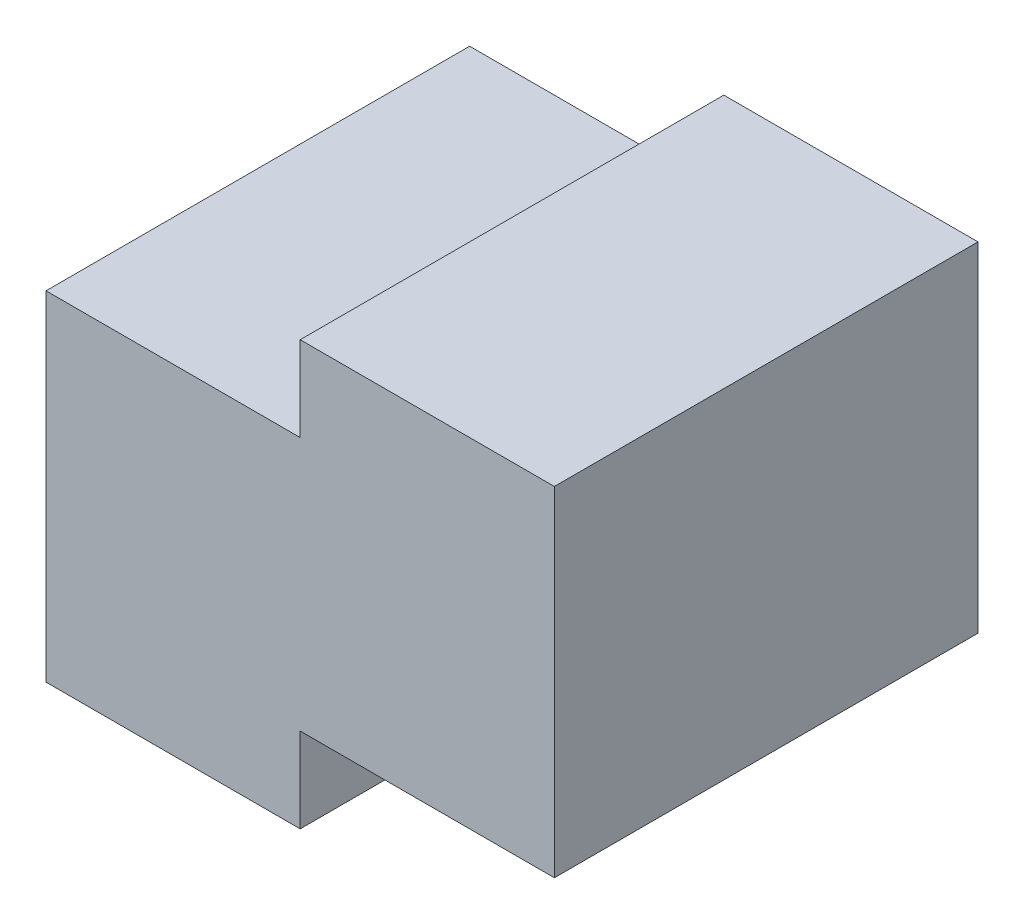
ISO-10303-21;
HEADER;
FILE_DESCRIPTION(('STEP AP214'),'2;1');
FILE_NAME('part.step','',(''),(''),'','','');
FILE_SCHEMA(('AUTOMOTIVE_DESIGN { 1 0 10303 214 1 1 1 1 }'));
ENDSEC;
DATA;
#1=APPLICATION_CONTEXT('core data for automotive mechanical design processes');
#2=APPLICATION_PROTOCOL_DEFINITION('international standard','automotive_design',2000,#1);
#3=PRODUCT_CONTEXT('',#1,'mechanical');
#4=PRODUCT('Part','Part','',(#3));
#5=PRODUCT_RELATED_PRODUCT_CATEGORY('part','',(#4));
#6=PRODUCT_DEFINITION_FORMATION('','',#4);
#7=PRODUCT_DEFINITION_CONTEXT('part definition',#1,'design');
#8=PRODUCT_DEFINITION('design','',#6,#7);
#9=PRODUCT_DEFINITION_SHAPE('','',#8);
#10=(LENGTH_UNIT() NAMED_UNIT(*) SI_UNIT(.MILLI.,.METRE.));
#11=(NAMED_UNIT(*) PLANE_ANGLE_UNIT() SI_UNIT($,.RADIAN.));
#12=(NAMED_UNIT(*) SI_UNIT($,.STERADIAN.) SOLID_ANGLE_UNIT());
#13=UNCERTAINTY_MEASURE_WITH_UNIT(LENGTH_MEASURE(1.E-05),#10,'distance_accuracy_value','');
#14=(GEOMETRIC_REPRESENTATION_CONTEXT(3) GLOBAL_UNCERTAINTY_ASSIGNED_CONTEXT((#13)) GLOBAL_UNIT_ASSIGNED_CONTEXT((#10,
#11,#12)) REPRESENTATION_CONTEXT('',''));
#15=CARTESIAN_POINT('',(0.,0.,0.));
#16=DIRECTION('',(0.,0.,1.));
#17=DIRECTION('',(1.,0.,0.));
#18=AXIS2_PLACEMENT_3D('',#15,#16,#17);
#19=CARTESIAN_POINT('',(-30.,-5.,25.));
#20=DIRECTION('',(1.,0.,0.));
#21=DIRECTION('',(0.,0.,-1.));
#22=AXIS2_PLACEMENT_3D('',#19,#20,#21);
#23=PLANE('',#22);
#24=DIRECTION('',(0.,-1.,0.));
#25=VECTOR('',#24,1.);
#26=CARTESIAN_POINT('',(-30.,-5.,0.));
#27=LINE('',#26,#25);
#28=CARTESIAN_POINT('',(-30.,15.,0.));
#29=VERTEX_POINT('',#28);
#30=CARTESIAN_POINT('',(-30.,-5.,0.));
#31=VERTEX_POINT('',#30);
#32=EDGE_CURVE('E129',#29,#31,#27,.T.);
#33=ORIENTED_EDGE('',*,*,#32,.T.);
#34=DIRECTION('',(0.,0.,-1.));
#35=VECTOR('',#34,1.);
#36=CARTESIAN_POINT('',(-30.,-5.,25.));
#37=LINE('',#36,#35);
#38=CARTESIAN_POINT('',(-30.,-5.,25.));
#39=VERTEX_POINT('',#38);
#40=EDGE_CURVE('E11',#39,#31,#37,.T.);
#41=ORIENTED_EDGE('',*,*,#40,.F.);
#42=DIRECTION('',(0.,-1.,0.));
#43=VECTOR('',#42,1.);
#44=CARTESIAN_POINT('',(-30.,-5.,25.));
#45=LINE('',#44,#43);
#46=CARTESIAN_POINT('',(-30.,15.,25.));
#47=VERTEX_POINT('',#46);
#48=EDGE_CURVE('E143',#47,#39,#45,.T.);
#49=ORIENTED_EDGE('',*,*,#48,.F.);
#50=DIRECTION('',(0.,0.,-1.));
#51=VECTOR('',#50,1.);
#52=CARTESIAN_POINT('',(-30.,15.,25.));
#53=LINE('',#52,#51);
#54=EDGE_CURVE('E125',#47,#29,#53,.T.);
#55=ORIENTED_EDGE('',*,*,#54,.T.);
#56=EDGE_LOOP('',(#33,#41,#49,#55));
#57=FACE_BOUND('',#56,.T.);
#58=ADVANCED_FACE('F33',(#57),#23,.F.);
#59=CARTESIAN_POINT('',(-15.,-5.,25.));
#60=DIRECTION('',(0.,1.,0.));
#61=DIRECTION('',(-1.,0.,0.));
#62=AXIS2_PLACEMENT_3D('',#59,#60,#61);
#63=PLANE('',#62);
#64=DIRECTION('',(1.,0.,0.));
#65=VECTOR('',#64,1.);
#66=CARTESIAN_POINT('',(-15.,-5.,0.));
#67=LINE('',#66,#65);
#68=CARTESIAN_POINT('',(-15.,-5.,0.));
#69=VERTEX_POINT('',#68);
#70=EDGE_CURVE('E132',#31,#69,#67,.T.);
#71=ORIENTED_EDGE('',*,*,#70,.T.);
#72=DIRECTION('',(0.,0.,-1.));
#73=VECTOR('',#72,1.);
#74=CARTESIAN_POINT('',(-15.,-5.,25.));
#75=LINE('',#74,#73);
#76=CARTESIAN_POINT('',(-15.,-5.,25.));
#77=VERTEX_POINT('',#76);
#78=EDGE_CURVE('E41',#77,#69,#75,.T.);
#79=ORIENTED_EDGE('',*,*,#78,.F.);
#80=DIRECTION('',(1.,0.,0.));
#81=VECTOR('',#80,1.);
#82=CARTESIAN_POINT('',(-15.,-5.,25.));
#83=LINE('',#82,#81);
#84=EDGE_CURVE('E92',#39,#77,#83,.T.);
#85=ORIENTED_EDGE('',*,*,#84,.F.);
#86=ORIENTED_EDGE('',*,*,#40,.T.);
#87=EDGE_LOOP('',(#71,#79,#85,#86));
#88=FACE_BOUND('',#87,.T.);
#89=ADVANCED_FACE('F178',(#88),#63,.F.);
#90=CARTESIAN_POINT('',(-15.,0.,25.));
#91=DIRECTION('',(-1.,0.,0.));
#92=DIRECTION('',(0.,0.,1.));
#93=AXIS2_PLACEMENT_3D('',#90,#91,#92);
#94=PLANE('',#93);
#95=DIRECTION('',(0.,1.,0.));
#96=VECTOR('',#95,1.);
#97=CARTESIAN_POINT('',(-15.,0.,0.));
#98=LINE('',#97,#96);
#99=CARTESIAN_POINT('',(-15.,0.,0.));
#100=VERTEX_POINT('',#99);
#101=EDGE_CURVE('E134',#69,#100,#98,.T.);
#102=ORIENTED_EDGE('',*,*,#101,.T.);
#103=DIRECTION('',(0.,0.,-1.));
#104=VECTOR('',#103,1.);
#105=CARTESIAN_POINT('',(-15.,0.,25.));
#106=LINE('',#105,#104);
#107=CARTESIAN_POINT('',(-15.,0.,25.));
#108=VERTEX_POINT('',#107);
#109=EDGE_CURVE('E150',#108,#100,#106,.T.);
#110=ORIENTED_EDGE('',*,*,#109,.F.);
#111=DIRECTION('',(0.,1.,0.));
#112=VECTOR('',#111,1.);
#113=CARTESIAN_POINT('',(-15.,0.,25.));
#114=LINE('',#113,#112);
#115=EDGE_CURVE('E158',#77,#108,#114,.T.);
#116=ORIENTED_EDGE('',*,*,#115,.F.);
#117=ORIENTED_EDGE('',*,*,#78,.T.);
#118=EDGE_LOOP('',(#102,#110,#116,#117));
#119=FACE_BOUND('',#118,.T.);
#120=ADVANCED_FACE('F156',(#119),#94,.F.);
#121=CARTESIAN_POINT('',(0.,0.,25.));
#122=DIRECTION('',(0.,1.,0.));
#123=DIRECTION('',(-1.,0.,0.));
#124=AXIS2_PLACEMENT_3D('',#121,#122,#123);
#125=PLANE('',#124);
#126=DIRECTION('',(1.,0.,0.));
#127=VECTOR('',#126,1.);
#128=CARTESIAN_POINT('',(0.,0.,0.));
#129=LINE('',#128,#127);
#130=CARTESIAN_POINT('',(0.,0.,0.));
#131=VERTEX_POINT('',#130);
#132=EDGE_CURVE('E136',#100,#131,#129,.T.);
#133=ORIENTED_EDGE('',*,*,#132,.T.);
#134=DIRECTION('',(0.,0.,-1.));
#135=VECTOR('',#134,1.);
#136=CARTESIAN_POINT('',(0.,0.,25.));
#137=LINE('',#136,#135);
#138=CARTESIAN_POINT('',(0.,0.,25.));
#139=VERTEX_POINT('',#138);
#140=EDGE_CURVE('E147',#139,#131,#137,.T.);
#141=ORIENTED_EDGE('',*,*,#140,.F.);
#142=DIRECTION('',(1.,0.,0.));
#143=VECTOR('',#142,1.);
#144=CARTESIAN_POINT('',(0.,0.,25.));
#145=LINE('',#144,#143);
#146=EDGE_CURVE('E170',#108,#139,#145,.T.);
#147=ORIENTED_EDGE('',*,*,#146,.F.);
#148=ORIENTED_EDGE('',*,*,#109,.T.);
#149=EDGE_LOOP('',(#133,#141,#147,#148));
#150=FACE_BOUND('',#149,.T.);
#151=ADVANCED_FACE('F166',(#150),#125,.F.);
#152=CARTESIAN_POINT('',(0.,20.,25.));
#153=DIRECTION('',(-1.,0.,0.));
#154=DIRECTION('',(0.,0.,1.));
#155=AXIS2_PLACEMENT_3D('',#152,#153,#154);
#156=PLANE('',#155);
#157=DIRECTION('',(0.,1.,0.));
#158=VECTOR('',#157,1.);
#159=CARTESIAN_POINT('',(0.,20.,0.));
#160=LINE('',#159,#158);
#161=CARTESIAN_POINT('',(0.,20.,0.));
#162=VERTEX_POINT('',#161);
#163=EDGE_CURVE('E138',#131,#162,#160,.T.);
#164=ORIENTED_EDGE('',*,*,#163,.T.);
#165=DIRECTION('',(0.,0.,-1.));
#166=VECTOR('',#165,1.);
#167=CARTESIAN_POINT('',(0.,20.,25.));
#168=LINE('',#167,#166);
#169=CARTESIAN_POINT('',(0.,20.,25.));
#170=VERTEX_POINT('',#169);
#171=EDGE_CURVE('E120',#170,#162,#168,.T.);
#172=ORIENTED_EDGE('',*,*,#171,.F.);
#173=DIRECTION('',(0.,1.,0.));
#174=VECTOR('',#173,1.);
#175=CARTESIAN_POINT('',(0.,20.,25.));
#176=LINE('',#175,#174);
#177=EDGE_CURVE('E111',#139,#170,#176,.T.);
#178=ORIENTED_EDGE('',*,*,#177,.F.);
#179=ORIENTED_EDGE('',*,*,#140,.T.);
#180=EDGE_LOOP('',(#164,#172,#178,#179));
#181=FACE_BOUND('',#180,.T.);
#182=ADVANCED_FACE('F169',(#181),#156,.F.);
#183=CARTESIAN_POINT('',(-15.,20.,25.));
#184=DIRECTION('',(0.,-1.,0.));
#185=DIRECTION('',(1.,0.,0.));
#186=AXIS2_PLACEMENT_3D('',#183,#184,#185);
#187=PLANE('',#186);
#188=DIRECTION('',(-1.,0.,0.));
#189=VECTOR('',#188,1.);
#190=CARTESIAN_POINT('',(-15.,20.,0.));
#191=LINE('',#190,#189);
#192=CARTESIAN_POINT('',(-15.,20.,0.));
#193=VERTEX_POINT('',#192);
#194=EDGE_CURVE('E119',#162,#193,#191,.T.);
#195=ORIENTED_EDGE('',*,*,#194,.T.);
#196=DIRECTION('',(0.,0.,-1.));
#197=VECTOR('',#196,1.);
#198=CARTESIAN_POINT('',(-15.,20.,25.));
#199=LINE('',#198,#197);
#200=CARTESIAN_POINT('',(-15.,20.,25.));
#201=VERTEX_POINT('',#200);
#202=EDGE_CURVE('E116',#201,#193,#199,.T.);
#203=ORIENTED_EDGE('',*,*,#202,.F.);
#204=DIRECTION('',(-1.,0.,0.));
#205=VECTOR('',#204,1.);
#206=CARTESIAN_POINT('',(-15.,20.,25.));
#207=LINE('',#206,#205);
#208=EDGE_CURVE('E105',#170,#201,#207,.T.);
#209=ORIENTED_EDGE('',*,*,#208,.F.);
#210=ORIENTED_EDGE('',*,*,#171,.T.);
#211=EDGE_LOOP('',(#195,#203,#209,#210));
#212=FACE_BOUND('',#211,.T.);
#213=ADVANCED_FACE('F117',(#212),#187,.F.);
#214=CARTESIAN_POINT('',(-15.,15.,25.));
#215=DIRECTION('',(1.,0.,0.));
#216=DIRECTION('',(0.,0.,-1.));
#217=AXIS2_PLACEMENT_3D('',#214,#215,#216);
#218=PLANE('',#217);
#219=DIRECTION('',(0.,-1.,0.));
#220=VECTOR('',#219,1.);
#221=CARTESIAN_POINT('',(-15.,15.,0.));
#222=LINE('',#221,#220);
#223=CARTESIAN_POINT('',(-15.,15.,0.));
#224=VERTEX_POINT('',#223);
#225=EDGE_CURVE('E78',#193,#224,#222,.T.);
#226=ORIENTED_EDGE('',*,*,#225,.T.);
#227=DIRECTION('',(0.,0.,-1.));
#228=VECTOR('',#227,1.);
#229=CARTESIAN_POINT('',(-15.,15.,25.));
#230=LINE('',#229,#228);
#231=CARTESIAN_POINT('',(-15.,15.,25.));
#232=VERTEX_POINT('',#231);
#233=EDGE_CURVE('E121',#232,#224,#230,.T.);
#234=ORIENTED_EDGE('',*,*,#233,.F.);
#235=DIRECTION('',(0.,-1.,0.));
#236=VECTOR('',#235,1.);
#237=CARTESIAN_POINT('',(-15.,15.,25.));
#238=LINE('',#237,#236);
#239=EDGE_CURVE('E109',#201,#232,#238,.T.);
#240=ORIENTED_EDGE('',*,*,#239,.F.);
#241=ORIENTED_EDGE('',*,*,#202,.T.);
#242=EDGE_LOOP('',(#226,#234,#240,#241));
#243=FACE_BOUND('',#242,.T.);
#244=ADVANCED_FACE('F123',(#243),#218,.F.);
#245=CARTESIAN_POINT('',(-30.,15.,25.));
#246=DIRECTION('',(0.,-1.,0.));
#247=DIRECTION('',(0.,0.,-1.));
#248=AXIS2_PLACEMENT_3D('',#245,#246,#247);
#249=PLANE('',#248);
#250=DIRECTION('',(-1.,0.,0.));
#251=VECTOR('',#250,1.);
#252=CARTESIAN_POINT('',(-30.,15.,0.));
#253=LINE('',#252,#251);
#254=EDGE_CURVE('E84',#224,#29,#253,.T.);
#255=ORIENTED_EDGE('',*,*,#254,.T.);
#256=ORIENTED_EDGE('',*,*,#54,.F.);
#257=DIRECTION('',(-1.,0.,0.));
#258=VECTOR('',#257,1.);
#259=CARTESIAN_POINT('',(-30.,15.,25.));
#260=LINE('',#259,#258);
#261=EDGE_CURVE('E49',#232,#47,#260,.T.);
#262=ORIENTED_EDGE('',*,*,#261,.F.);
#263=ORIENTED_EDGE('',*,*,#233,.T.);
#264=EDGE_LOOP('',(#255,#256,#262,#263));
#265=FACE_BOUND('',#264,.T.);
#266=ADVANCED_FACE('F194',(#265),#249,.F.);
#267=CARTESIAN_POINT('',(0.,0.,25.));
#268=DIRECTION('',(0.,0.,-1.));
#269=DIRECTION('',(-1.,0.,0.));
#270=AXIS2_PLACEMENT_3D('',#267,#268,#269);
#271=PLANE('',#270);
#272=ORIENTED_EDGE('',*,*,#48,.T.);
#273=ORIENTED_EDGE('',*,*,#84,.T.);
#274=ORIENTED_EDGE('',*,*,#115,.T.);
#275=ORIENTED_EDGE('',*,*,#146,.T.);
#276=ORIENTED_EDGE('',*,*,#177,.T.);
#277=ORIENTED_EDGE('',*,*,#208,.T.);
#278=ORIENTED_EDGE('',*,*,#239,.T.);
#279=ORIENTED_EDGE('',*,*,#261,.T.);
#280=EDGE_LOOP('',(#272,#273,#274,#275,#276,#277,#278,#279));
#281=FACE_BOUND('',#280,.T.);
#282=ADVANCED_FACE('F107',(#281),#271,.F.);
#283=CARTESIAN_POINT('',(0.,0.,0.));
#284=DIRECTION('',(0.,0.,-1.));
#285=DIRECTION('',(-1.,0.,0.));
#286=AXIS2_PLACEMENT_3D('',#283,#284,#285);
#287=PLANE('',#286);
#288=ORIENTED_EDGE('',*,*,#32,.F.);
#289=ORIENTED_EDGE('',*,*,#254,.F.);
#290=ORIENTED_EDGE('',*,*,#225,.F.);
#291=ORIENTED_EDGE('',*,*,#194,.F.);
#292=ORIENTED_EDGE('',*,*,#163,.F.);
#293=ORIENTED_EDGE('',*,*,#132,.F.);
#294=ORIENTED_EDGE('',*,*,#101,.F.);
#295=ORIENTED_EDGE('',*,*,#70,.F.);
#296=EDGE_LOOP('',(#288,#289,#290,#291,#292,#293,#294,#295));
#297=FACE_BOUND('',#296,.T.);
#298=ADVANCED_FACE('F162',(#297),#287,.T.);
#299=CLOSED_SHELL('',(#58,#89,#120,#151,#182,#213,#244,#266,#282,#298));
#300=MANIFOLD_SOLID_BREP('B2',#299);
#301=ADVANCED_BREP_SHAPE_REPRESENTATION('',(#18,#300),#14);
#302=SHAPE_DEFINITION_REPRESENTATION(#9,#301);
ENDSEC;
END-ISO-10303-21;
